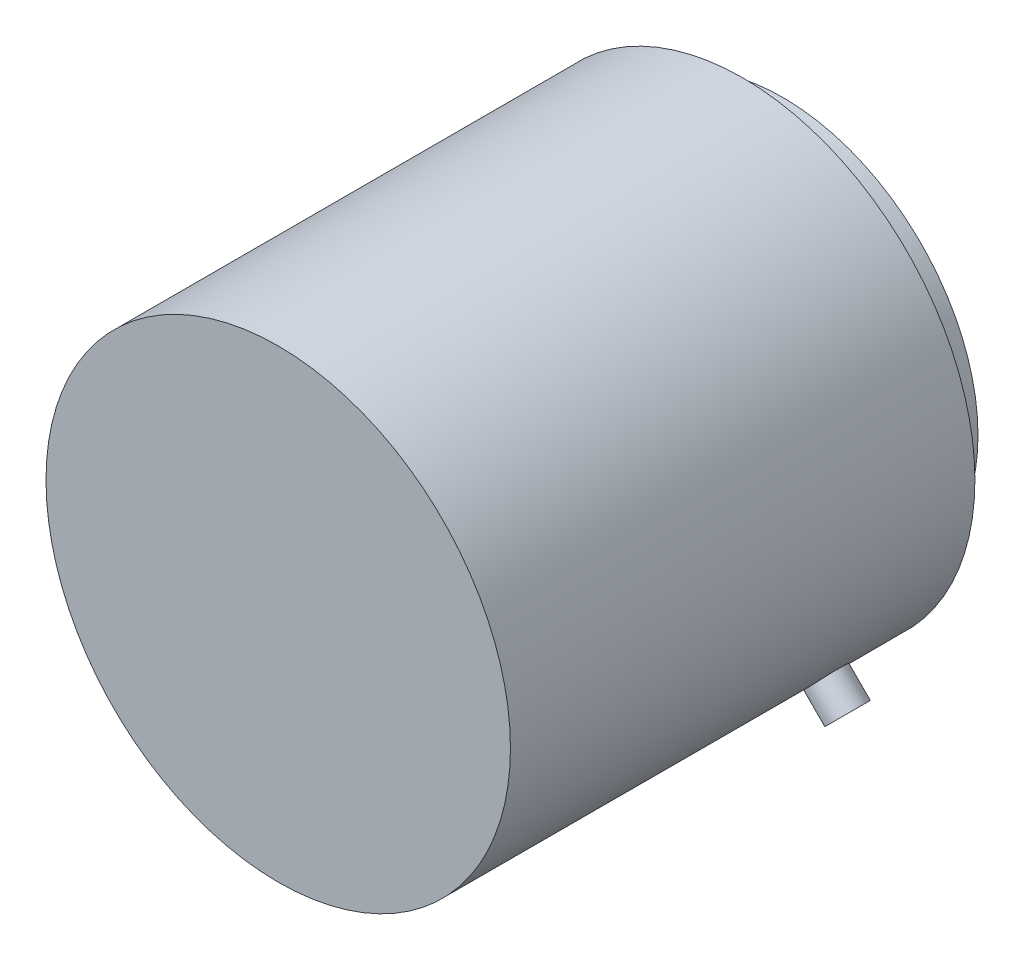
ISO-10303-21;
HEADER;
FILE_DESCRIPTION(('STEP AP214'),'2;1');
FILE_NAME('part.step','',(''),(''),'','','');
FILE_SCHEMA(('AUTOMOTIVE_DESIGN { 1 0 10303 214 1 1 1 1 }'));
ENDSEC;
DATA;
#1=APPLICATION_CONTEXT('core data for automotive mechanical design processes');
#2=APPLICATION_PROTOCOL_DEFINITION('international standard','automotive_design',2000,#1);
#3=PRODUCT_CONTEXT('',#1,'mechanical');
#4=PRODUCT('Part','Part','',(#3));
#5=PRODUCT_RELATED_PRODUCT_CATEGORY('part','',(#4));
#6=PRODUCT_DEFINITION_FORMATION('','',#4);
#7=PRODUCT_DEFINITION_CONTEXT('part definition',#1,'design');
#8=PRODUCT_DEFINITION('design','',#6,#7);
#9=PRODUCT_DEFINITION_SHAPE('','',#8);
#10=(LENGTH_UNIT() NAMED_UNIT(*) SI_UNIT(.MILLI.,.METRE.));
#11=(NAMED_UNIT(*) PLANE_ANGLE_UNIT() SI_UNIT($,.RADIAN.));
#12=(NAMED_UNIT(*) SI_UNIT($,.STERADIAN.) SOLID_ANGLE_UNIT());
#13=UNCERTAINTY_MEASURE_WITH_UNIT(LENGTH_MEASURE(1.E-05),#10,'distance_accuracy_value','');
#14=(GEOMETRIC_REPRESENTATION_CONTEXT(3) GLOBAL_UNCERTAINTY_ASSIGNED_CONTEXT((#13)) GLOBAL_UNIT_ASSIGNED_CONTEXT((#10,
#11,#12)) REPRESENTATION_CONTEXT('',''));
#15=CARTESIAN_POINT('',(0.,0.,0.));
#16=DIRECTION('',(0.,0.,1.));
#17=DIRECTION('',(1.,0.,0.));
#18=AXIS2_PLACEMENT_3D('',#15,#16,#17);
#19=CARTESIAN_POINT('',(0.,0.,75.));
#20=DIRECTION('',(0.,0.,-1.));
#21=DIRECTION('',(-1.,0.,0.));
#22=AXIS2_PLACEMENT_3D('',#19,#20,#21);
#23=CYLINDRICAL_SURFACE('',#22,37.5);
#24=CARTESIAN_POINT('',(0.,0.,0.));
#25=DIRECTION('',(0.,0.,1.));
#26=DIRECTION('',(1.,0.,0.));
#27=AXIS2_PLACEMENT_3D('',#24,#25,#26);
#28=CIRCLE('',#27,37.5);
#29=CARTESIAN_POINT('',(37.5,0.,0.));
#30=VERTEX_POINT('',#29);
#31=EDGE_CURVE('E43',#30,#30,#28,.T.);
#32=ORIENTED_EDGE('',*,*,#31,.T.);
#33=EDGE_LOOP('',(#32));
#34=FACE_BOUND('',#33,.T.);
#35=CARTESIAN_POINT('',(0.,0.,75.));
#36=DIRECTION('',(0.,0.,1.));
#37=DIRECTION('',(1.,0.,0.));
#38=AXIS2_PLACEMENT_3D('',#35,#36,#37);
#39=CIRCLE('',#38,37.5);
#40=CARTESIAN_POINT('',(37.5,0.,75.));
#41=VERTEX_POINT('',#40);
#42=EDGE_CURVE('E47',#41,#41,#39,.T.);
#43=ORIENTED_EDGE('',*,*,#42,.F.);
#44=EDGE_LOOP('',(#43));
#45=FACE_BOUND('',#44,.T.);
#46=CARTESIAN_POINT('',(28.5528356236188,-24.3101949364995,13.));
#47=CARTESIAN_POINT('',(28.5528315482279,-24.310201267945,13.1682217805113));
#48=CARTESIAN_POINT('',(28.5436085374536,-24.3210452644874,13.3365586695876));
#49=CARTESIAN_POINT('',(28.5068844547034,-24.3640782287865,13.6685764846228));
#50=CARTESIAN_POINT('',(28.4793625709765,-24.3962915002416,13.8322518876713));
#51=CARTESIAN_POINT('',(28.4066416415261,-24.4809273727148,14.150089837267));
#52=CARTESIAN_POINT('',(28.3614524935343,-24.5333386579649,14.3042576543587));
#53=CARTESIAN_POINT('',(28.254393102274,-24.6565589582037,14.5987835614831));
#54=CARTESIAN_POINT('',(28.1925264704621,-24.7273639899642,14.739144632352));
#55=CARTESIAN_POINT('',(28.0533328737985,-24.8851677589476,15.0024436166233));
#56=CARTESIAN_POINT('',(27.975973625506,-24.9722002843752,15.1253442162503));
#57=CARTESIAN_POINT('',(27.8076458496916,-25.1595042375032,15.3499131707981));
#58=CARTESIAN_POINT('',(27.7166767327748,-25.2597762385361,15.4515806057291));
#59=CARTESIAN_POINT('',(27.5231702362607,-25.4704840287883,15.6309201505452));
#60=CARTESIAN_POINT('',(27.4206176295145,-25.5809331604626,15.7085601619347));
#61=CARTESIAN_POINT('',(27.2066141052785,-25.8084193651309,15.8374356109949));
#62=CARTESIAN_POINT('',(27.0951633327085,-25.9254563308232,15.8886714785946));
#63=CARTESIAN_POINT('',(26.86654803303,-26.1622937325889,15.9631773447933));
#64=CARTESIAN_POINT('',(26.749396358228,-26.2820876584723,15.9865074685791));
#65=CARTESIAN_POINT('',(26.5123855018544,-26.5211564946033,16.0047254250461));
#66=CARTESIAN_POINT('',(26.3925263671205,-26.6404314137868,15.9996137493815));
#67=CARTESIAN_POINT('',(26.1538184124611,-26.8748154828555,15.9611424516771));
#68=CARTESIAN_POINT('',(26.0349679083917,-26.9899335396195,15.9278474876673));
#69=CARTESIAN_POINT('',(25.8015207277942,-27.2131885648705,15.8340552374197));
#70=CARTESIAN_POINT('',(25.6869240890492,-27.3213254713568,15.7735577096288));
#71=CARTESIAN_POINT('',(25.4653574124538,-27.5279598228137,15.6270053643566));
#72=CARTESIAN_POINT('',(25.3583962062207,-27.6264461528491,15.5409215276912));
#73=CARTESIAN_POINT('',(25.155601529751,-27.8112308614741,15.345661243736));
#74=CARTESIAN_POINT('',(25.0597682673024,-27.8975290124847,15.2364843653456));
#75=CARTESIAN_POINT('',(24.8820674298783,-28.0561397456436,14.9977725756066));
#76=CARTESIAN_POINT('',(24.8002397291193,-28.1284124727068,14.8681814918983));
#77=CARTESIAN_POINT('',(24.65359697318,-28.2570292250348,14.5925158501963));
#78=CARTESIAN_POINT('',(24.5887819304811,-28.3133732386136,14.4464412801094));
#79=CARTESIAN_POINT('',(24.4783645770772,-28.4088898827734,14.1419162714132));
#80=CARTESIAN_POINT('',(24.4327643775052,-28.4480606265482,13.9834644751853));
#81=CARTESIAN_POINT('',(24.362375116024,-28.5083644881889,13.6587013217372));
#82=CARTESIAN_POINT('',(24.3375856513212,-28.5294979551681,13.4923901167024));
#83=CARTESIAN_POINT('',(24.3097312211382,-28.5532363966048,13.157122155257));
#84=CARTESIAN_POINT('',(24.306606284418,-28.5558925196839,12.9881740005658));
#85=CARTESIAN_POINT('',(24.3220323831403,-28.5427545867873,12.6519947579073));
#86=CARTESIAN_POINT('',(24.3405832324818,-28.5269606892174,12.4847636552104));
#87=CARTESIAN_POINT('',(24.3986678073813,-28.4772971177111,12.1569905579716));
#88=CARTESIAN_POINT('',(24.4381737399466,-28.4434513858242,11.9964400063962));
#89=CARTESIAN_POINT('',(24.5367806194607,-28.3584310260251,11.6863205517287));
#90=CARTESIAN_POINT('',(24.5958818565488,-28.3072561415273,11.5367518112795));
#91=CARTESIAN_POINT('',(24.731819154493,-28.1885659417855,11.252481881074));
#92=CARTESIAN_POINT('',(24.8086937843067,-28.1210150743123,11.1178139802796));
#93=CARTESIAN_POINT('',(24.9775439965959,-27.9711459434592,10.8675047041756));
#94=CARTESIAN_POINT('',(25.0695198187464,-27.8888274456964,10.7518636309042));
#95=CARTESIAN_POINT('',(25.2658075683556,-27.7111259425136,10.5426229349867));
#96=CARTESIAN_POINT('',(25.3701472279308,-27.6157134885765,10.449074326952));
#97=CARTESIAN_POINT('',(25.5876695631188,-27.4142865832021,10.2870239201568));
#98=CARTESIAN_POINT('',(25.7008521563262,-27.3082722305592,10.218521888026));
#99=CARTESIAN_POINT('',(25.9324115964861,-27.0884746787672,10.1085969690206));
#100=CARTESIAN_POINT('',(26.0507821930125,-26.9747007410385,10.0671424035137));
#101=CARTESIAN_POINT('',(26.289276543161,-26.7423193875541,10.0123855999363));
#102=CARTESIAN_POINT('',(26.4094002664226,-26.6237120554396,9.99908287491349));
#103=CARTESIAN_POINT('',(26.647571319747,-26.3853227057639,10.0010128551603));
#104=CARTESIAN_POINT('',(26.7656235104254,-26.2655448921367,10.0161659988353));
#105=CARTESIAN_POINT('',(26.9967142497511,-26.0279636778756,10.0744118293223));
#106=CARTESIAN_POINT('',(27.1097527911655,-25.9101602800901,10.117504556439));
#107=CARTESIAN_POINT('',(27.327811682046,-25.6800672268992,10.2303864477635));
#108=CARTESIAN_POINT('',(27.432832408013,-25.5677773126796,10.3001743574914));
#109=CARTESIAN_POINT('',(27.6322104152921,-25.3521702411086,10.4644562569439));
#110=CARTESIAN_POINT('',(27.7265678843717,-25.2488529257676,10.5589498115339));
#111=CARTESIAN_POINT('',(27.9025895444063,-25.0541971214925,10.7702590042659));
#112=CARTESIAN_POINT('',(27.9842192853997,-24.9628912445546,10.8871333806559));
#113=CARTESIAN_POINT('',(28.132609738489,-24.7955402050393,11.1397834156812));
#114=CARTESIAN_POINT('',(28.1993668383407,-24.7194987503037,11.2755636531583));
#115=CARTESIAN_POINT('',(28.3165905955814,-24.5851314120326,11.5624149017336));
#116=CARTESIAN_POINT('',(28.3670284087632,-24.5268369067118,11.7135123737396));
#117=CARTESIAN_POINT('',(28.4502968468143,-24.4302009014247,12.0264122446402));
#118=CARTESIAN_POINT('',(28.4831477833826,-24.3918363851417,12.1882020508009));
#119=CARTESIAN_POINT('',(28.5221529386265,-24.3461970042085,12.4591273961235));
#120=CARTESIAN_POINT('',(28.5336469682494,-24.3327173297713,12.5665188029175));
#121=CARTESIAN_POINT('',(28.5489896184624,-24.3147142607091,12.782590779442));
#122=CARTESIAN_POINT('',(28.5528382577115,-24.310190844226,12.8912713460256));
#123=CARTESIAN_POINT('',(28.5528356236188,-24.3101949364995,13.));
#124=B_SPLINE_CURVE_WITH_KNOTS('',3,(#46,#47,#48,#49,#50,#51,#52,#53,#54,#55,#56,#57,#58,#59,
#60,#61,#62,#63,#64,#65,#66,#67,#68,#69,#70,#71,#72,#73,#74,#75,#76,#77,#78,#79,#80,#81,#82,#83,
#84,#85,#86,#87,#88,#89,#90,#91,#92,#93,#94,#95,#96,#97,#98,#99,#100,#101,#102,#103,#104,#105,
#106,#107,#108,#109,#110,#111,#112,#113,#114,#115,#116,#117,#118,#119,#120,#121,#122,#123),
.UNSPECIFIED.,.T.,.F.,(4,2,2,2,2,2,2,2,2,2,2,2,2,2,2,2,2,2,2,2,2,2,2,2,2,2,2,2,2,2,2,2,2,2,2,2,
2,2,4),(0.,0.504268364075818,1.0091112280477,1.51367166824146,2.01812293511167,2.52363652233804,
3.02917200789855,3.53537995719301,4.04157966382834,4.54668674619373,5.05178509714362,
5.55572778361588,6.05967494508446,6.56419586280023,7.0687261997387,7.57466988117898,
8.080613933805,8.58661355997038,9.09260339224114,9.59719199400924,10.101776263582,
10.6056929639124,11.1096171258551,11.6146452608634,12.1196814120815,12.6258726026439,
13.1320590766739,13.6376516238102,14.1432354254646,14.6474077371311,15.1515807761024,
15.6557301255099,16.1598705960523,16.6653527758188,17.1709575927922,17.6774512413761,
18.1833586538131,18.5092888283267,18.8352182073951),.UNSPECIFIED.);
#125=CARTESIAN_POINT('',(28.5528356236188,-24.3101949364995,13.));
#126=VERTEX_POINT('',#125);
#127=EDGE_CURVE('E67',#126,#126,#124,.T.);
#128=ORIENTED_EDGE('',*,*,#127,.F.);
#129=EDGE_LOOP('',(#128));
#130=FACE_BOUND('',#129,.T.);
#131=ADVANCED_FACE('F39',(#34,#45,#130),#23,.T.);
#132=CARTESIAN_POINT('',(0.,0.,75.));
#133=DIRECTION('',(0.,0.,1.));
#134=DIRECTION('',(1.,0.,0.));
#135=AXIS2_PLACEMENT_3D('',#132,#133,#134);
#136=PLANE('',#135);
#137=ORIENTED_EDGE('',*,*,#42,.T.);
#138=EDGE_LOOP('',(#137));
#139=FACE_BOUND('',#138,.T.);
#140=ADVANCED_FACE('F151',(#139),#136,.T.);
#141=CARTESIAN_POINT('',(0.,0.,0.));
#142=DIRECTION('',(0.,0.,1.));
#143=DIRECTION('',(1.,0.,0.));
#144=AXIS2_PLACEMENT_3D('',#141,#142,#143);
#145=PLANE('',#144);
#146=CARTESIAN_POINT('',(0.,0.,0.));
#147=DIRECTION('',(0.,0.,-1.));
#148=DIRECTION('',(-1.,0.,0.));
#149=AXIS2_PLACEMENT_3D('',#146,#147,#148);
#150=CIRCLE('',#149,31.5);
#151=CARTESIAN_POINT('',(31.5,0.,0.));
#152=VERTEX_POINT('',#151);
#153=EDGE_CURVE('E11',#152,#152,#150,.T.);
#154=ORIENTED_EDGE('',*,*,#153,.F.);
#155=EDGE_LOOP('',(#154));
#156=FACE_BOUND('',#155,.T.);
#157=ORIENTED_EDGE('',*,*,#31,.F.);
#158=EDGE_LOOP('',(#157));
#159=FACE_BOUND('',#158,.T.);
#160=ADVANCED_FACE('F149',(#156,#159),#145,.F.);
#161=CARTESIAN_POINT('',(0.,0.,-6.5));
#162=DIRECTION('',(0.,0.,1.));
#163=DIRECTION('',(1.,0.,0.));
#164=AXIS2_PLACEMENT_3D('',#161,#162,#163);
#165=CYLINDRICAL_SURFACE('',#164,31.5);
#166=CARTESIAN_POINT('',(0.,0.,-6.5));
#167=DIRECTION('',(0.,0.,-1.));
#168=DIRECTION('',(-1.,0.,0.));
#169=AXIS2_PLACEMENT_3D('',#166,#167,#168);
#170=CIRCLE('',#169,31.5);
#171=CARTESIAN_POINT('',(31.5,0.,-6.5));
#172=VERTEX_POINT('',#171);
#173=EDGE_CURVE('E53',#172,#172,#170,.T.);
#174=CARTESIAN_POINT('',(31.5,0.,-6.5));
#175=CARTESIAN_POINT('',(31.5,0.,-6.43229166666667));
#176=CARTESIAN_POINT('',(31.5,0.,-6.36458333333333));
#177=CARTESIAN_POINT('',(31.5,0.,-6.22916666666667));
#178=CARTESIAN_POINT('',(31.5,0.,-6.16145833333333));
#179=CARTESIAN_POINT('',(31.5,0.,-6.02604166666667));
#180=CARTESIAN_POINT('',(31.5,0.,-5.95833333333333));
#181=CARTESIAN_POINT('',(31.5,0.,-5.82291666666667));
#182=CARTESIAN_POINT('',(31.5,0.,-5.75520833333333));
#183=CARTESIAN_POINT('',(31.5,0.,-5.61979166666667));
#184=CARTESIAN_POINT('',(31.5,0.,-5.55208333333333));
#185=CARTESIAN_POINT('',(31.5,0.,-5.41666666666667));
#186=CARTESIAN_POINT('',(31.5,0.,-5.34895833333333));
#187=CARTESIAN_POINT('',(31.5,0.,-5.21354166666667));
#188=CARTESIAN_POINT('',(31.5,0.,-5.14583333333333));
#189=CARTESIAN_POINT('',(31.5,0.,-5.01041666666667));
#190=CARTESIAN_POINT('',(31.5,0.,-4.94270833333333));
#191=CARTESIAN_POINT('',(31.5,0.,-4.80729166666667));
#192=CARTESIAN_POINT('',(31.5,0.,-4.73958333333333));
#193=CARTESIAN_POINT('',(31.5,0.,-4.60416666666667));
#194=CARTESIAN_POINT('',(31.5,0.,-4.53645833333333));
#195=CARTESIAN_POINT('',(31.5,0.,-4.40104166666667));
#196=CARTESIAN_POINT('',(31.5,0.,-4.33333333333333));
#197=CARTESIAN_POINT('',(31.5,0.,-4.19791666666667));
#198=CARTESIAN_POINT('',(31.5,0.,-4.13020833333333));
#199=CARTESIAN_POINT('',(31.5,0.,-3.99479166666667));
#200=CARTESIAN_POINT('',(31.5,0.,-3.92708333333333));
#201=CARTESIAN_POINT('',(31.5,0.,-3.79166666666667));
#202=CARTESIAN_POINT('',(31.5,0.,-3.72395833333333));
#203=CARTESIAN_POINT('',(31.5,0.,-3.58854166666667));
#204=CARTESIAN_POINT('',(31.5,0.,-3.52083333333333));
#205=CARTESIAN_POINT('',(31.5,0.,-3.38541666666667));
#206=CARTESIAN_POINT('',(31.5,0.,-3.31770833333333));
#207=CARTESIAN_POINT('',(31.5,0.,-3.18229166666667));
#208=CARTESIAN_POINT('',(31.5,0.,-3.11458333333333));
#209=CARTESIAN_POINT('',(31.5,0.,-2.97916666666667));
#210=CARTESIAN_POINT('',(31.5,0.,-2.91145833333333));
#211=CARTESIAN_POINT('',(31.5,0.,-2.77604166666667));
#212=CARTESIAN_POINT('',(31.5,0.,-2.70833333333333));
#213=CARTESIAN_POINT('',(31.5,0.,-2.57291666666667));
#214=CARTESIAN_POINT('',(31.5,0.,-2.50520833333333));
#215=CARTESIAN_POINT('',(31.5,0.,-2.36979166666667));
#216=CARTESIAN_POINT('',(31.5,0.,-2.30208333333333));
#217=CARTESIAN_POINT('',(31.5,0.,-2.16666666666667));
#218=CARTESIAN_POINT('',(31.5,0.,-2.09895833333333));
#219=CARTESIAN_POINT('',(31.5,0.,-1.96354166666667));
#220=CARTESIAN_POINT('',(31.5,0.,-1.89583333333333));
#221=CARTESIAN_POINT('',(31.5,0.,-1.76041666666667));
#222=CARTESIAN_POINT('',(31.5,0.,-1.69270833333333));
#223=CARTESIAN_POINT('',(31.5,0.,-1.55729166666667));
#224=CARTESIAN_POINT('',(31.5,0.,-1.48958333333333));
#225=CARTESIAN_POINT('',(31.5,0.,-1.35416666666667));
#226=CARTESIAN_POINT('',(31.5,0.,-1.28645833333333));
#227=CARTESIAN_POINT('',(31.5,0.,-1.15104166666667));
#228=CARTESIAN_POINT('',(31.5,0.,-1.08333333333333));
#229=CARTESIAN_POINT('',(31.5,0.,-0.947916666666667));
#230=CARTESIAN_POINT('',(31.5,0.,-0.880208333333333));
#231=CARTESIAN_POINT('',(31.5,0.,-0.744791666666667));
#232=CARTESIAN_POINT('',(31.5,0.,-0.677083333333333));
#233=CARTESIAN_POINT('',(31.5,0.,-0.541666666666667));
#234=CARTESIAN_POINT('',(31.5,0.,-0.473958333333333));
#235=CARTESIAN_POINT('',(31.5,0.,-0.338541666666667));
#236=CARTESIAN_POINT('',(31.5,0.,-0.270833333333334));
#237=CARTESIAN_POINT('',(31.5,0.,-0.135416666666667));
#238=CARTESIAN_POINT('',(31.5,0.,-0.0677083333333334));
#239=CARTESIAN_POINT('',(31.5,0.,0.));
#240=B_SPLINE_CURVE_WITH_KNOTS('',3,(#174,#175,#176,#177,#178,#179,#180,#181,#182,#183,#184,
#185,#186,#187,#188,#189,#190,#191,#192,#193,#194,#195,#196,#197,#198,#199,#200,#201,#202,#203,
#204,#205,#206,#207,#208,#209,#210,#211,#212,#213,#214,#215,#216,#217,#218,#219,#220,#221,#222,
#223,#224,#225,#226,#227,#228,#229,#230,#231,#232,#233,#234,#235,#236,#237,#238,#239),
.UNSPECIFIED.,.F.,.F.,(4,2,2,2,2,2,2,2,2,2,2,2,2,2,2,2,2,2,2,2,2,2,2,2,2,2,2,2,2,2,2,2,4),(0.,
0.203125,0.40625,0.609375000000001,0.812500000000001,1.015625,1.21875,1.421875,1.625,1.828125,
2.03125,2.234375,2.4375,2.640625,2.84375,3.046875,3.25,3.453125,3.65625,3.859375,4.0625,
4.265625,4.46875,4.671875,4.875,5.078125,5.28125,5.484375,5.6875,5.890625,6.09375,6.296875,6.5),.UNSPECIFIED.);
#241=EDGE_CURVE('BSEAM145',#172,#152,#240,.T.);
#242=ORIENTED_EDGE('',*,*,#173,.F.);
#243=ORIENTED_EDGE('',*,*,#153,.T.);
#244=ORIENTED_EDGE('',*,*,#241,.T.);
#245=ORIENTED_EDGE('',*,*,#241,.F.);
#246=EDGE_LOOP('',(#242,#244,#243,#245));
#247=FACE_BOUND('',#246,.T.);
#248=ADVANCED_FACE('F145',(#247),#165,.T.);
#249=CARTESIAN_POINT('',(0.,0.,-6.5));
#250=DIRECTION('',(0.,0.,-1.));
#251=DIRECTION('',(-1.,0.,0.));
#252=AXIS2_PLACEMENT_3D('',#249,#250,#251);
#253=PLANE('',#252);
#254=CARTESIAN_POINT('',(0.,-25.,-6.5));
#255=DIRECTION('',(0.,0.,-1.));
#256=DIRECTION('',(-1.,0.,0.));
#257=AXIS2_PLACEMENT_3D('',#254,#255,#256);
#258=CIRCLE('',#257,3.);
#259=CARTESIAN_POINT('',(-3.,-25.,-6.5));
#260=VERTEX_POINT('',#259);
#261=EDGE_CURVE('E82',#260,#260,#258,.T.);
#262=ORIENTED_EDGE('',*,*,#261,.F.);
#263=EDGE_LOOP('',(#262));
#264=FACE_BOUND('',#263,.T.);
#265=CARTESIAN_POINT('',(25.,0.,-6.5));
#266=DIRECTION('',(0.,0.,-1.));
#267=DIRECTION('',(-1.,0.,0.));
#268=AXIS2_PLACEMENT_3D('',#265,#266,#267);
#269=CIRCLE('',#268,3.);
#270=CARTESIAN_POINT('',(22.,0.,-6.5));
#271=VERTEX_POINT('',#270);
#272=EDGE_CURVE('E79',#271,#271,#269,.T.);
#273=ORIENTED_EDGE('',*,*,#272,.F.);
#274=EDGE_LOOP('',(#273));
#275=FACE_BOUND('',#274,.T.);
#276=CARTESIAN_POINT('',(0.,25.,-6.5));
#277=DIRECTION('',(0.,0.,-1.));
#278=DIRECTION('',(-1.,0.,0.));
#279=AXIS2_PLACEMENT_3D('',#276,#277,#278);
#280=CIRCLE('',#279,3.);
#281=CARTESIAN_POINT('',(-3.,25.,-6.5));
#282=VERTEX_POINT('',#281);
#283=EDGE_CURVE('E73',#282,#282,#280,.T.);
#284=ORIENTED_EDGE('',*,*,#283,.F.);
#285=EDGE_LOOP('',(#284));
#286=FACE_BOUND('',#285,.T.);
#287=CARTESIAN_POINT('',(-25.,0.,-6.5));
#288=DIRECTION('',(0.,0.,-1.));
#289=DIRECTION('',(-1.,0.,0.));
#290=AXIS2_PLACEMENT_3D('',#287,#288,#289);
#291=CIRCLE('',#290,3.);
#292=CARTESIAN_POINT('',(-28.,0.,-6.5));
#293=VERTEX_POINT('',#292);
#294=EDGE_CURVE('E66',#293,#293,#291,.T.);
#295=ORIENTED_EDGE('',*,*,#294,.F.);
#296=EDGE_LOOP('',(#295));
#297=FACE_BOUND('',#296,.T.);
#298=CARTESIAN_POINT('',(0.,0.,-6.5));
#299=DIRECTION('',(0.,0.,-1.));
#300=DIRECTION('',(-1.,0.,0.));
#301=AXIS2_PLACEMENT_3D('',#298,#299,#300);
#302=CIRCLE('',#301,15.75);
#303=CARTESIAN_POINT('',(-15.75,0.,-6.5));
#304=VERTEX_POINT('',#303);
#305=EDGE_CURVE('E57',#304,#304,#302,.T.);
#306=ORIENTED_EDGE('',*,*,#305,.F.);
#307=EDGE_LOOP('',(#306));
#308=FACE_BOUND('',#307,.T.);
#309=ORIENTED_EDGE('',*,*,#173,.T.);
#310=EDGE_LOOP('',(#309));
#311=FACE_BOUND('',#310,.T.);
#312=ADVANCED_FACE('F141',(#264,#275,#286,#297,#308,#311),#253,.T.);
#313=CARTESIAN_POINT('',(0.,0.,0.));
#314=DIRECTION('',(0.,0.,-1.));
#315=DIRECTION('',(-1.,0.,0.));
#316=AXIS2_PLACEMENT_3D('',#313,#314,#315);
#317=CYLINDRICAL_SURFACE('',#316,15.75);
#318=CARTESIAN_POINT('',(0.,0.,0.));
#319=DIRECTION('',(0.,0.,-1.));
#320=DIRECTION('',(-1.,0.,0.));
#321=AXIS2_PLACEMENT_3D('',#318,#319,#320);
#322=CIRCLE('',#321,15.75);
#323=CARTESIAN_POINT('',(-15.75,0.,0.));
#324=VERTEX_POINT('',#323);
#325=EDGE_CURVE('E56',#324,#324,#322,.T.);
#326=CARTESIAN_POINT('',(-15.75,0.,0.));
#327=CARTESIAN_POINT('',(-15.75,0.,-0.0677083333333332));
#328=CARTESIAN_POINT('',(-15.75,0.,-0.135416666666667));
#329=CARTESIAN_POINT('',(-15.75,0.,-0.270833333333333));
#330=CARTESIAN_POINT('',(-15.75,0.,-0.338541666666667));
#331=CARTESIAN_POINT('',(-15.75,0.,-0.473958333333333));
#332=CARTESIAN_POINT('',(-15.75,0.,-0.541666666666667));
#333=CARTESIAN_POINT('',(-15.75,0.,-0.677083333333333));
#334=CARTESIAN_POINT('',(-15.75,0.,-0.744791666666667));
#335=CARTESIAN_POINT('',(-15.75,0.,-0.880208333333333));
#336=CARTESIAN_POINT('',(-15.75,0.,-0.947916666666667));
#337=CARTESIAN_POINT('',(-15.75,0.,-1.08333333333333));
#338=CARTESIAN_POINT('',(-15.75,0.,-1.15104166666667));
#339=CARTESIAN_POINT('',(-15.75,0.,-1.28645833333333));
#340=CARTESIAN_POINT('',(-15.75,0.,-1.35416666666667));
#341=CARTESIAN_POINT('',(-15.75,0.,-1.48958333333333));
#342=CARTESIAN_POINT('',(-15.75,0.,-1.55729166666667));
#343=CARTESIAN_POINT('',(-15.75,0.,-1.69270833333333));
#344=CARTESIAN_POINT('',(-15.75,0.,-1.76041666666667));
#345=CARTESIAN_POINT('',(-15.75,0.,-1.89583333333333));
#346=CARTESIAN_POINT('',(-15.75,0.,-1.96354166666667));
#347=CARTESIAN_POINT('',(-15.75,0.,-2.09895833333333));
#348=CARTESIAN_POINT('',(-15.75,0.,-2.16666666666667));
#349=CARTESIAN_POINT('',(-15.75,0.,-2.30208333333333));
#350=CARTESIAN_POINT('',(-15.75,0.,-2.36979166666667));
#351=CARTESIAN_POINT('',(-15.75,0.,-2.50520833333333));
#352=CARTESIAN_POINT('',(-15.75,0.,-2.57291666666667));
#353=CARTESIAN_POINT('',(-15.75,0.,-2.70833333333333));
#354=CARTESIAN_POINT('',(-15.75,0.,-2.77604166666667));
#355=CARTESIAN_POINT('',(-15.75,0.,-2.91145833333333));
#356=CARTESIAN_POINT('',(-15.75,0.,-2.97916666666667));
#357=CARTESIAN_POINT('',(-15.75,0.,-3.11458333333333));
#358=CARTESIAN_POINT('',(-15.75,0.,-3.18229166666667));
#359=CARTESIAN_POINT('',(-15.75,0.,-3.31770833333333));
#360=CARTESIAN_POINT('',(-15.75,0.,-3.38541666666667));
#361=CARTESIAN_POINT('',(-15.75,0.,-3.52083333333333));
#362=CARTESIAN_POINT('',(-15.75,0.,-3.58854166666667));
#363=CARTESIAN_POINT('',(-15.75,0.,-3.72395833333333));
#364=CARTESIAN_POINT('',(-15.75,0.,-3.79166666666667));
#365=CARTESIAN_POINT('',(-15.75,0.,-3.92708333333333));
#366=CARTESIAN_POINT('',(-15.75,0.,-3.99479166666667));
#367=CARTESIAN_POINT('',(-15.75,0.,-4.13020833333333));
#368=CARTESIAN_POINT('',(-15.75,0.,-4.19791666666667));
#369=CARTESIAN_POINT('',(-15.75,0.,-4.33333333333333));
#370=CARTESIAN_POINT('',(-15.75,0.,-4.40104166666667));
#371=CARTESIAN_POINT('',(-15.75,0.,-4.53645833333333));
#372=CARTESIAN_POINT('',(-15.75,0.,-4.60416666666667));
#373=CARTESIAN_POINT('',(-15.75,0.,-4.73958333333333));
#374=CARTESIAN_POINT('',(-15.75,0.,-4.80729166666667));
#375=CARTESIAN_POINT('',(-15.75,0.,-4.94270833333333));
#376=CARTESIAN_POINT('',(-15.75,0.,-5.01041666666667));
#377=CARTESIAN_POINT('',(-15.75,0.,-5.14583333333333));
#378=CARTESIAN_POINT('',(-15.75,0.,-5.21354166666667));
#379=CARTESIAN_POINT('',(-15.75,0.,-5.34895833333333));
#380=CARTESIAN_POINT('',(-15.75,0.,-5.41666666666667));
#381=CARTESIAN_POINT('',(-15.75,0.,-5.55208333333333));
#382=CARTESIAN_POINT('',(-15.75,0.,-5.61979166666667));
#383=CARTESIAN_POINT('',(-15.75,0.,-5.75520833333333));
#384=CARTESIAN_POINT('',(-15.75,0.,-5.82291666666667));
#385=CARTESIAN_POINT('',(-15.75,0.,-5.95833333333333));
#386=CARTESIAN_POINT('',(-15.75,0.,-6.02604166666667));
#387=CARTESIAN_POINT('',(-15.75,0.,-6.16145833333333));
#388=CARTESIAN_POINT('',(-15.75,0.,-6.22916666666667));
#389=CARTESIAN_POINT('',(-15.75,0.,-6.36458333333333));
#390=CARTESIAN_POINT('',(-15.75,0.,-6.43229166666667));
#391=CARTESIAN_POINT('',(-15.75,0.,-6.5));
#392=B_SPLINE_CURVE_WITH_KNOTS('',3,(#326,#327,#328,#329,#330,#331,#332,#333,#334,#335,#336,
#337,#338,#339,#340,#341,#342,#343,#344,#345,#346,#347,#348,#349,#350,#351,#352,#353,#354,#355,
#356,#357,#358,#359,#360,#361,#362,#363,#364,#365,#366,#367,#368,#369,#370,#371,#372,#373,#374,
#375,#376,#377,#378,#379,#380,#381,#382,#383,#384,#385,#386,#387,#388,#389,#390,#391),
.UNSPECIFIED.,.F.,.F.,(4,2,2,2,2,2,2,2,2,2,2,2,2,2,2,2,2,2,2,2,2,2,2,2,2,2,2,2,2,2,2,2,4),(0.,
0.203125,0.40625,0.609375,0.8125,1.015625,1.21875,1.421875,1.625,1.828125,2.03125,2.234375,
2.4375,2.640625,2.84375,3.046875,3.25,3.453125,3.65625,3.859375,4.0625,4.265625,4.46875,
4.671875,4.875,5.078125,5.28125,5.484375,5.6875,5.890625,6.09375,6.296875,6.5),.UNSPECIFIED.);
#393=EDGE_CURVE('BSEAM137',#324,#304,#392,.T.);
#394=ORIENTED_EDGE('',*,*,#325,.F.);
#395=ORIENTED_EDGE('',*,*,#305,.T.);
#396=ORIENTED_EDGE('',*,*,#393,.T.);
#397=ORIENTED_EDGE('',*,*,#393,.F.);
#398=EDGE_LOOP('',(#394,#396,#395,#397));
#399=FACE_BOUND('',#398,.T.);
#400=ADVANCED_FACE('F137',(#399),#317,.F.);
#401=CARTESIAN_POINT('',(0.,0.,0.));
#402=DIRECTION('',(0.,0.,-1.));
#403=DIRECTION('',(-1.,0.,0.));
#404=AXIS2_PLACEMENT_3D('',#401,#402,#403);
#405=PLANE('',#404);
#406=ORIENTED_EDGE('',*,*,#325,.T.);
#407=EDGE_LOOP('',(#406));
#408=FACE_BOUND('',#407,.T.);
#409=ADVANCED_FACE('F130',(#408),#405,.T.);
#410=CARTESIAN_POINT('',(-25.,0.,-1.5));
#411=DIRECTION('',(0.,0.,-1.));
#412=DIRECTION('',(-1.,0.,0.));
#413=AXIS2_PLACEMENT_3D('',#410,#411,#412);
#414=CYLINDRICAL_SURFACE('',#413,3.);
#415=ORIENTED_EDGE('',*,*,#294,.T.);
#416=EDGE_LOOP('',(#415));
#417=FACE_BOUND('',#416,.T.);
#418=CARTESIAN_POINT('',(-25.,0.,-1.5));
#419=DIRECTION('',(0.,0.,-1.));
#420=DIRECTION('',(-1.,0.,0.));
#421=AXIS2_PLACEMENT_3D('',#418,#419,#420);
#422=CIRCLE('',#421,3.);
#423=CARTESIAN_POINT('',(-28.,0.,-1.5));
#424=VERTEX_POINT('',#423);
#425=EDGE_CURVE('E63',#424,#424,#422,.T.);
#426=ORIENTED_EDGE('',*,*,#425,.F.);
#427=EDGE_LOOP('',(#426));
#428=FACE_BOUND('',#427,.T.);
#429=ADVANCED_FACE('F127',(#417,#428),#414,.F.);
#430=CARTESIAN_POINT('',(0.,0.,-1.5));
#431=DIRECTION('',(0.,0.,-1.));
#432=DIRECTION('',(-1.,0.,0.));
#433=AXIS2_PLACEMENT_3D('',#430,#431,#432);
#434=PLANE('',#433);
#435=ORIENTED_EDGE('',*,*,#425,.T.);
#436=EDGE_LOOP('',(#435));
#437=FACE_BOUND('',#436,.T.);
#438=ADVANCED_FACE('F122',(#437),#434,.T.);
#439=CARTESIAN_POINT('',(0.,25.,-1.5));
#440=DIRECTION('',(0.,0.,-1.));
#441=DIRECTION('',(-1.,0.,0.));
#442=AXIS2_PLACEMENT_3D('',#439,#440,#441);
#443=CYLINDRICAL_SURFACE('',#442,3.);
#444=CARTESIAN_POINT('',(0.,25.,-1.5));
#445=DIRECTION('',(0.,0.,-1.));
#446=DIRECTION('',(-1.,0.,0.));
#447=AXIS2_PLACEMENT_3D('',#444,#445,#446);
#448=CIRCLE('',#447,3.);
#449=CARTESIAN_POINT('',(-3.,25.,-1.5));
#450=VERTEX_POINT('',#449);
#451=EDGE_CURVE('E70',#450,#450,#448,.T.);
#452=ORIENTED_EDGE('',*,*,#451,.F.);
#453=EDGE_LOOP('',(#452));
#454=FACE_BOUND('',#453,.T.);
#455=ORIENTED_EDGE('',*,*,#283,.T.);
#456=EDGE_LOOP('',(#455));
#457=FACE_BOUND('',#456,.T.);
#458=ADVANCED_FACE('F119',(#454,#457),#443,.F.);
#459=CARTESIAN_POINT('',(0.,0.,-1.5));
#460=DIRECTION('',(0.,0.,-1.));
#461=DIRECTION('',(-1.,0.,0.));
#462=AXIS2_PLACEMENT_3D('',#459,#460,#461);
#463=PLANE('',#462);
#464=ORIENTED_EDGE('',*,*,#451,.T.);
#465=EDGE_LOOP('',(#464));
#466=FACE_BOUND('',#465,.T.);
#467=ADVANCED_FACE('F114',(#466),#463,.T.);
#468=CARTESIAN_POINT('',(25.,0.,-1.5));
#469=DIRECTION('',(0.,0.,-1.));
#470=DIRECTION('',(-1.,0.,0.));
#471=AXIS2_PLACEMENT_3D('',#468,#469,#470);
#472=CYLINDRICAL_SURFACE('',#471,3.);
#473=CARTESIAN_POINT('',(25.,0.,-1.5));
#474=DIRECTION('',(0.,0.,-1.));
#475=DIRECTION('',(-1.,0.,0.));
#476=AXIS2_PLACEMENT_3D('',#473,#474,#475);
#477=CIRCLE('',#476,3.);
#478=CARTESIAN_POINT('',(22.,0.,-1.5));
#479=VERTEX_POINT('',#478);
#480=EDGE_CURVE('E76',#479,#479,#477,.T.);
#481=ORIENTED_EDGE('',*,*,#480,.F.);
#482=EDGE_LOOP('',(#481));
#483=FACE_BOUND('',#482,.T.);
#484=ORIENTED_EDGE('',*,*,#272,.T.);
#485=EDGE_LOOP('',(#484));
#486=FACE_BOUND('',#485,.T.);
#487=ADVANCED_FACE('F111',(#483,#486),#472,.F.);
#488=CARTESIAN_POINT('',(25.,0.,-1.5));
#489=DIRECTION('',(0.,0.,-1.));
#490=DIRECTION('',(-1.,0.,0.));
#491=AXIS2_PLACEMENT_3D('',#488,#489,#490);
#492=PLANE('',#491);
#493=ORIENTED_EDGE('',*,*,#480,.T.);
#494=EDGE_LOOP('',(#493));
#495=FACE_BOUND('',#494,.T.);
#496=ADVANCED_FACE('F109',(#495),#492,.T.);
#497=CARTESIAN_POINT('',(0.,-25.,-1.5));
#498=DIRECTION('',(0.,0.,-1.));
#499=DIRECTION('',(-1.,0.,0.));
#500=AXIS2_PLACEMENT_3D('',#497,#498,#499);
#501=CYLINDRICAL_SURFACE('',#500,3.);
#502=CARTESIAN_POINT('',(0.,-25.,-1.5));
#503=DIRECTION('',(0.,0.,-1.));
#504=DIRECTION('',(-1.,0.,0.));
#505=AXIS2_PLACEMENT_3D('',#502,#503,#504);
#506=CIRCLE('',#505,3.);
#507=CARTESIAN_POINT('',(-3.,-25.,-1.5));
#508=VERTEX_POINT('',#507);
#509=EDGE_CURVE('E60',#508,#508,#506,.T.);
#510=ORIENTED_EDGE('',*,*,#509,.F.);
#511=EDGE_LOOP('',(#510));
#512=FACE_BOUND('',#511,.T.);
#513=ORIENTED_EDGE('',*,*,#261,.T.);
#514=EDGE_LOOP('',(#513));
#515=FACE_BOUND('',#514,.T.);
#516=ADVANCED_FACE('F105',(#512,#515),#501,.F.);
#517=CARTESIAN_POINT('',(0.,-25.,-1.5));
#518=DIRECTION('',(0.,0.,-1.));
#519=DIRECTION('',(-1.,0.,0.));
#520=AXIS2_PLACEMENT_3D('',#517,#518,#519);
#521=PLANE('',#520);
#522=ORIENTED_EDGE('',*,*,#509,.T.);
#523=EDGE_LOOP('',(#522));
#524=FACE_BOUND('',#523,.T.);
#525=ADVANCED_FACE('F98',(#524),#521,.T.);
#526=CARTESIAN_POINT('',(-37.501,37.501,13.));
#527=DIRECTION('',(0.707106781186547,-0.707106781186548,0.));
#528=DIRECTION('',(0.707106781186548,0.707106781186547,0.));
#529=AXIS2_PLACEMENT_3D('',#526,#527,#528);
#530=CYLINDRICAL_SURFACE('',#529,3.);
#531=CARTESIAN_POINT('',(29.9414042357069,-29.941404235707,13.));
#532=DIRECTION('',(0.707106781186547,-0.707106781186548,0.));
#533=DIRECTION('',(0.707106781186548,0.707106781186547,0.));
#534=AXIS2_PLACEMENT_3D('',#531,#532,#533);
#535=CIRCLE('',#534,3.);
#536=CARTESIAN_POINT('',(32.0627245792666,-27.8200838921473,13.));
#537=VERTEX_POINT('',#536);
#538=EDGE_CURVE('E92',#537,#537,#535,.T.);
#539=ORIENTED_EDGE('',*,*,#538,.F.);
#540=EDGE_LOOP('',(#539));
#541=FACE_BOUND('',#540,.T.);
#542=ORIENTED_EDGE('',*,*,#127,.T.);
#543=EDGE_LOOP('',(#542));
#544=FACE_BOUND('',#543,.T.);
#545=ADVANCED_FACE('F93',(#541,#544),#530,.T.);
#546=CARTESIAN_POINT('',(29.9414042357069,-29.941404235707,16.));
#547=DIRECTION('',(-0.707106781186547,0.707106781186548,0.));
#548=DIRECTION('',(-0.707106781186548,-0.707106781186547,0.));
#549=AXIS2_PLACEMENT_3D('',#546,#547,#548);
#550=PLANE('',#549);
#551=ORIENTED_EDGE('',*,*,#538,.T.);
#552=EDGE_LOOP('',(#551));
#553=FACE_BOUND('',#552,.T.);
#554=ADVANCED_FACE('F97',(#553),#550,.F.);
#555=CLOSED_SHELL('',(#131,#140,#160,#248,#312,#400,#409,#429,#438,#458,#467,#487,#496,#516,
#525,#545,#554));
#556=MANIFOLD_SOLID_BREP('B2',#555);
#557=ADVANCED_BREP_SHAPE_REPRESENTATION('',(#18,#556),#14);
#558=SHAPE_DEFINITION_REPRESENTATION(#9,#557);
ENDSEC;
END-ISO-10303-21;
